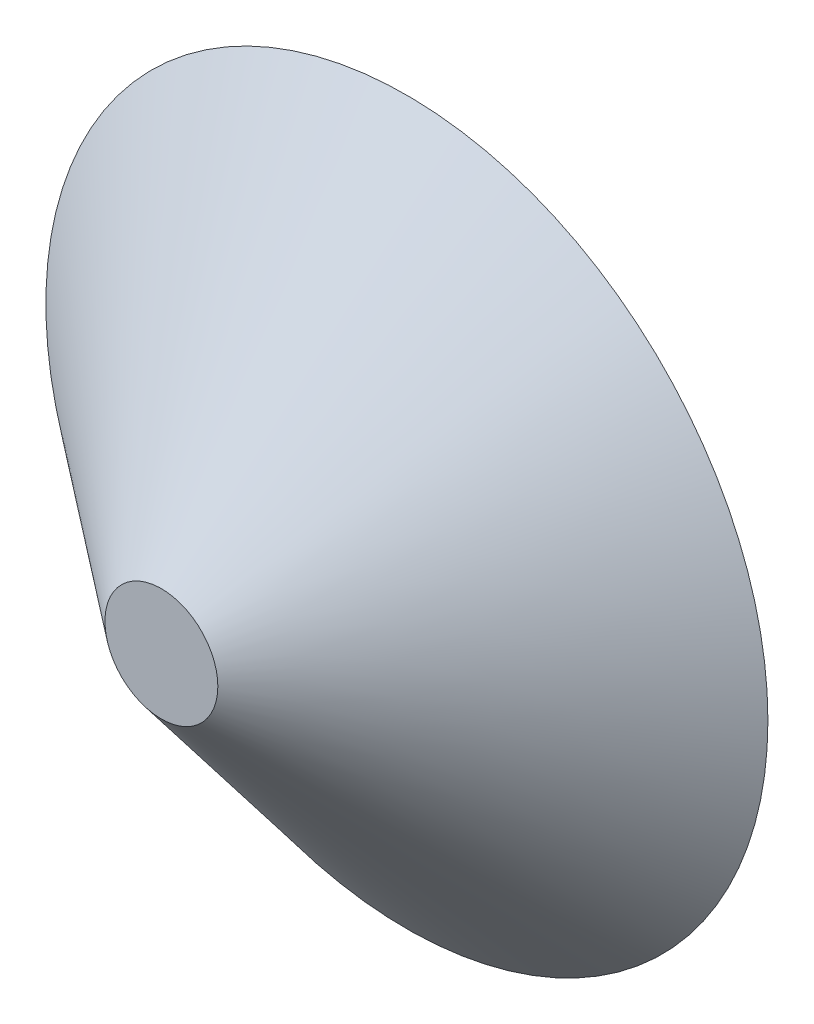
ISO-10303-21;
HEADER;
FILE_DESCRIPTION(('STEP AP214'),'2;1');
FILE_NAME('part.step','',(''),(''),'','','');
FILE_SCHEMA(('AUTOMOTIVE_DESIGN { 1 0 10303 214 1 1 1 1 }'));
ENDSEC;
DATA;
#1=APPLICATION_CONTEXT('core data for automotive mechanical design processes');
#2=APPLICATION_PROTOCOL_DEFINITION('international standard','automotive_design',2000,#1);
#3=PRODUCT_CONTEXT('',#1,'mechanical');
#4=PRODUCT('Part','Part','',(#3));
#5=PRODUCT_RELATED_PRODUCT_CATEGORY('part','',(#4));
#6=PRODUCT_DEFINITION_FORMATION('','',#4);
#7=PRODUCT_DEFINITION_CONTEXT('part definition',#1,'design');
#8=PRODUCT_DEFINITION('design','',#6,#7);
#9=PRODUCT_DEFINITION_SHAPE('','',#8);
#10=(LENGTH_UNIT() NAMED_UNIT(*) SI_UNIT(.MILLI.,.METRE.));
#11=(NAMED_UNIT(*) PLANE_ANGLE_UNIT() SI_UNIT($,.RADIAN.));
#12=(NAMED_UNIT(*) SI_UNIT($,.STERADIAN.) SOLID_ANGLE_UNIT());
#13=UNCERTAINTY_MEASURE_WITH_UNIT(LENGTH_MEASURE(1.E-05),#10,'distance_accuracy_value','');
#14=(GEOMETRIC_REPRESENTATION_CONTEXT(3) GLOBAL_UNCERTAINTY_ASSIGNED_CONTEXT((#13)) GLOBAL_UNIT_ASSIGNED_CONTEXT((#10,
#11,#12)) REPRESENTATION_CONTEXT('',''));
#15=CARTESIAN_POINT('',(0.,0.,0.));
#16=DIRECTION('',(0.,0.,1.));
#17=DIRECTION('',(1.,0.,0.));
#18=AXIS2_PLACEMENT_3D('',#15,#16,#17);
#19=CARTESIAN_POINT('',(0.,0.,0.));
#20=DIRECTION('',(0.,0.,-1.));
#21=DIRECTION('',(1.,0.,0.));
#22=AXIS2_PLACEMENT_3D('',#19,#20,#21);
#23=CONICAL_SURFACE('',#22,140.,0.892386846544703);
#24=CARTESIAN_POINT('',(0.,0.,95.2));
#25=DIRECTION('',(0.,0.,1.));
#26=DIRECTION('',(1.,0.,0.));
#27=AXIS2_PLACEMENT_3D('',#24,#25,#26);
#28=CIRCLE('',#27,21.8908586619484);
#29=CARTESIAN_POINT('',(21.8908586619484,0.,95.2));
#30=VERTEX_POINT('',#29);
#31=EDGE_CURVE('E10',#30,#30,#28,.T.);
#32=CARTESIAN_POINT('',(0.,0.,0.));
#33=DIRECTION('',(0.,0.,1.));
#34=DIRECTION('',(1.,0.,0.));
#35=AXIS2_PLACEMENT_3D('',#32,#33,#34);
#36=CIRCLE('',#35,140.);
#37=CARTESIAN_POINT('',(140.,0.,0.));
#38=VERTEX_POINT('',#37);
#39=EDGE_CURVE('E39',#38,#38,#36,.T.);
#40=CARTESIAN_POINT('',(21.8908586619484,0.,95.2));
#41=CARTESIAN_POINT('',(23.1211622175531,0.,94.2083333333333));
#42=CARTESIAN_POINT('',(24.3514657731578,0.,93.2166666666667));
#43=CARTESIAN_POINT('',(26.8120728843672,0.,91.2333333333333));
#44=CARTESIAN_POINT('',(28.0423764399719,0.,90.2416666666667));
#45=CARTESIAN_POINT('',(30.5029835511813,0.,88.2583333333333));
#46=CARTESIAN_POINT('',(31.733287106786,0.,87.2666666666667));
#47=CARTESIAN_POINT('',(34.1938942179955,0.,85.2833333333333));
#48=CARTESIAN_POINT('',(35.4241977736002,0.,84.2916666666667));
#49=CARTESIAN_POINT('',(37.8848048848096,0.,82.3083333333334));
#50=CARTESIAN_POINT('',(39.1151084404143,0.,81.3166666666667));
#51=CARTESIAN_POINT('',(41.5757155516237,0.,79.3333333333333));
#52=CARTESIAN_POINT('',(42.8060191072284,0.,78.3416666666667));
#53=CARTESIAN_POINT('',(45.2666262184378,0.,76.3583333333333));
#54=CARTESIAN_POINT('',(46.4969297740425,0.,75.3666666666667));
#55=CARTESIAN_POINT('',(48.9575368852519,0.,73.3833333333333));
#56=CARTESIAN_POINT('',(50.1878404408566,0.,72.3916666666667));
#57=CARTESIAN_POINT('',(52.648447552066,0.,70.4083333333333));
#58=CARTESIAN_POINT('',(53.8787511076707,0.,69.4166666666667));
#59=CARTESIAN_POINT('',(56.3393582188801,0.,67.4333333333334));
#60=CARTESIAN_POINT('',(57.5696617744848,0.,66.4416666666667));
#61=CARTESIAN_POINT('',(60.0302688856943,0.,64.4583333333333));
#62=CARTESIAN_POINT('',(61.260572441299,0.,63.4666666666667));
#63=CARTESIAN_POINT('',(63.7211795525084,0.,61.4833333333333));
#64=CARTESIAN_POINT('',(64.9514831081131,0.,60.4916666666667));
#65=CARTESIAN_POINT('',(67.4120902193225,0.,58.5083333333333));
#66=CARTESIAN_POINT('',(68.6423937749272,0.,57.5166666666667));
#67=CARTESIAN_POINT('',(71.1030008861366,0.,55.5333333333333));
#68=CARTESIAN_POINT('',(72.3333044417413,0.,54.5416666666667));
#69=CARTESIAN_POINT('',(74.7939115529507,0.,52.5583333333333));
#70=CARTESIAN_POINT('',(76.0242151085554,0.,51.5666666666667));
#71=CARTESIAN_POINT('',(78.4848222197648,0.,49.5833333333333));
#72=CARTESIAN_POINT('',(79.7151257753695,0.,48.5916666666667));
#73=CARTESIAN_POINT('',(82.1757328865789,0.,46.6083333333333));
#74=CARTESIAN_POINT('',(83.4060364421836,0.,45.6166666666667));
#75=CARTESIAN_POINT('',(85.866643553393,0.,43.6333333333333));
#76=CARTESIAN_POINT('',(87.0969471089978,0.,42.6416666666667));
#77=CARTESIAN_POINT('',(89.5575542202072,0.,40.6583333333333));
#78=CARTESIAN_POINT('',(90.7878577758119,0.,39.6666666666667));
#79=CARTESIAN_POINT('',(93.2484648870213,0.,37.6833333333333));
#80=CARTESIAN_POINT('',(94.478768442626,0.,36.6916666666667));
#81=CARTESIAN_POINT('',(96.9393755538354,0.,34.7083333333333));
#82=CARTESIAN_POINT('',(98.1696791094401,0.,33.7166666666667));
#83=CARTESIAN_POINT('',(100.630286220649,0.,31.7333333333333));
#84=CARTESIAN_POINT('',(101.860589776254,0.,30.7416666666667));
#85=CARTESIAN_POINT('',(104.321196887464,0.,28.7583333333333));
#86=CARTESIAN_POINT('',(105.551500443068,0.,27.7666666666667));
#87=CARTESIAN_POINT('',(108.012107554278,0.,25.7833333333333));
#88=CARTESIAN_POINT('',(109.242411109882,0.,24.7916666666667));
#89=CARTESIAN_POINT('',(111.703018221092,0.,22.8083333333333));
#90=CARTESIAN_POINT('',(112.933321776697,0.,21.8166666666667));
#91=CARTESIAN_POINT('',(115.393928887906,0.,19.8333333333333));
#92=CARTESIAN_POINT('',(116.624232443511,0.,18.8416666666667));
#93=CARTESIAN_POINT('',(119.08483955472,0.,16.8583333333333));
#94=CARTESIAN_POINT('',(120.315143110325,0.,15.8666666666667));
#95=CARTESIAN_POINT('',(122.775750221534,0.,13.8833333333333));
#96=CARTESIAN_POINT('',(124.006053777139,0.,12.8916666666667));
#97=CARTESIAN_POINT('',(126.466660888348,0.,10.9083333333333));
#98=CARTESIAN_POINT('',(127.696964443953,0.,9.91666666666667));
#99=CARTESIAN_POINT('',(130.157571555162,0.,7.93333333333333));
#100=CARTESIAN_POINT('',(131.387875110767,0.,6.94166666666667));
#101=CARTESIAN_POINT('',(133.848482221977,0.,4.95833333333333));
#102=CARTESIAN_POINT('',(135.078785777581,0.,3.96666666666667));
#103=CARTESIAN_POINT('',(137.539392888791,0.,1.98333333333334));
#104=CARTESIAN_POINT('',(138.769696444395,0.,0.991666666666666));
#105=CARTESIAN_POINT('',(140.,0.,0.));
#106=B_SPLINE_CURVE_WITH_KNOTS('',3,(#40,#41,#42,#43,#44,#45,#46,#47,#48,#49,#50,#51,#52,#53,
#54,#55,#56,#57,#58,#59,#60,#61,#62,#63,#64,#65,#66,#67,#68,#69,#70,#71,#72,#73,#74,#75,#76,#77,
#78,#79,#80,#81,#82,#83,#84,#85,#86,#87,#88,#89,#90,#91,#92,#93,#94,#95,#96,#97,#98,#99,#100,
#101,#102,#103,#104,#105),.UNSPECIFIED.,.F.,.F.,(4,2,2,2,2,2,2,2,2,2,2,2,2,2,2,2,2,2,2,2,2,2,2,
2,2,2,2,2,2,2,2,2,4),(0.,4.74061668460996,9.48123336921989,14.2218500538298,18.9624667384398,
23.7030834230497,28.4437001076597,33.1843167922696,37.9249334768796,42.6655501614895,
47.4061668460995,52.1467835307094,56.8874002153194,61.6280168999293,66.3686335845393,
71.1092502691492,75.8498669537592,80.5904836383691,85.331100322979,90.071717007589,
94.8123336921989,99.5529503768089,104.293567061419,109.034183746029,113.774800430639,
118.515417115249,123.256033799859,127.996650484469,132.737267169079,137.477883853688,
142.218500538298,146.959117222908,151.699733907518),.UNSPECIFIED.);
#107=EDGE_CURVE('BSEAM33',#30,#38,#106,.T.);
#108=ORIENTED_EDGE('',*,*,#31,.F.);
#109=ORIENTED_EDGE('',*,*,#39,.T.);
#110=ORIENTED_EDGE('',*,*,#107,.T.);
#111=ORIENTED_EDGE('',*,*,#107,.F.);
#112=EDGE_LOOP('',(#108,#110,#109,#111));
#113=FACE_BOUND('',#112,.T.);
#114=ADVANCED_FACE('F33',(#113),#23,.T.);
#115=CARTESIAN_POINT('',(0.,0.,95.2));
#116=DIRECTION('',(0.,0.,1.));
#117=DIRECTION('',(1.,0.,0.));
#118=AXIS2_PLACEMENT_3D('',#115,#116,#117);
#119=PLANE('',#118);
#120=ORIENTED_EDGE('',*,*,#31,.T.);
#121=EDGE_LOOP('',(#120));
#122=FACE_BOUND('',#121,.T.);
#123=ADVANCED_FACE('F67',(#122),#119,.T.);
#124=CARTESIAN_POINT('',(0.,0.,0.));
#125=DIRECTION('',(0.,0.,1.));
#126=DIRECTION('',(1.,0.,0.));
#127=AXIS2_PLACEMENT_3D('',#124,#125,#126);
#128=PLANE('',#127);
#129=CARTESIAN_POINT('',(0.,0.,0.));
#130=DIRECTION('',(0.,0.,1.));
#131=DIRECTION('',(1.,0.,0.));
#132=AXIS2_PLACEMENT_3D('',#129,#130,#131);
#133=CIRCLE('',#132,129.992916712823);
#134=CARTESIAN_POINT('',(129.992916712823,0.,0.));
#135=VERTEX_POINT('',#134);
#136=EDGE_CURVE('E47',#135,#135,#133,.T.);
#137=ORIENTED_EDGE('',*,*,#136,.T.);
#138=EDGE_LOOP('',(#137));
#139=FACE_BOUND('',#138,.T.);
#140=ORIENTED_EDGE('',*,*,#39,.F.);
#141=EDGE_LOOP('',(#140));
#142=FACE_BOUND('',#141,.T.);
#143=ADVANCED_FACE('F53',(#139,#142),#128,.F.);
#144=CARTESIAN_POINT('',(0.,0.,-4.88943117102069));
#145=DIRECTION('',(0.,0.,-1.));
#146=DIRECTION('',(1.,0.,0.));
#147=AXIS2_PLACEMENT_3D('',#144,#145,#146);
#148=CONICAL_SURFACE('',#147,136.058951557789,0.892386846544703);
#149=CARTESIAN_POINT('',(0.,0.,90.2));
#150=DIRECTION('',(0.,0.,1.));
#151=DIRECTION('',(1.,0.,0.));
#152=AXIS2_PLACEMENT_3D('',#149,#150,#151);
#153=CIRCLE('',#152,18.0869865795014);
#154=CARTESIAN_POINT('',(18.0869865795014,0.,90.2));
#155=VERTEX_POINT('',#154);
#156=EDGE_CURVE('E43',#155,#155,#153,.T.);
#157=CARTESIAN_POINT('',(18.0869865795014,0.,90.2));
#158=CARTESIAN_POINT('',(19.2526733517235,0.,89.2604166666666));
#159=CARTESIAN_POINT('',(20.4183601239456,0.,88.3208333333333));
#160=CARTESIAN_POINT('',(22.7497336683898,0.,86.4416666666666));
#161=CARTESIAN_POINT('',(23.9154204406119,0.,85.5020833333333));
#162=CARTESIAN_POINT('',(26.2467939850561,0.,83.6229166666667));
#163=CARTESIAN_POINT('',(27.4124807572782,0.,82.6833333333333));
#164=CARTESIAN_POINT('',(29.7438543017225,0.,80.8041666666667));
#165=CARTESIAN_POINT('',(30.9095410739446,0.,79.8645833333333));
#166=CARTESIAN_POINT('',(33.2409146183888,0.,77.9854166666667));
#167=CARTESIAN_POINT('',(34.4066013906109,0.,77.0458333333333));
#168=CARTESIAN_POINT('',(36.7379749350551,0.,75.1666666666667));
#169=CARTESIAN_POINT('',(37.9036617072772,0.,74.2270833333333));
#170=CARTESIAN_POINT('',(40.2350352517214,0.,72.3479166666666));
#171=CARTESIAN_POINT('',(41.4007220239435,0.,71.4083333333333));
#172=CARTESIAN_POINT('',(43.7320955683877,0.,69.5291666666667));
#173=CARTESIAN_POINT('',(44.8977823406098,0.,68.5895833333333));
#174=CARTESIAN_POINT('',(47.229155885054,0.,66.7104166666667));
#175=CARTESIAN_POINT('',(48.3948426572761,0.,65.7708333333333));
#176=CARTESIAN_POINT('',(50.7262162017203,0.,63.8916666666667));
#177=CARTESIAN_POINT('',(51.8919029739424,0.,62.9520833333333));
#178=CARTESIAN_POINT('',(54.2232765183867,0.,61.0729166666666));
#179=CARTESIAN_POINT('',(55.3889632906088,0.,60.1333333333333));
#180=CARTESIAN_POINT('',(57.720336835053,0.,58.2541666666666));
#181=CARTESIAN_POINT('',(58.8860236072751,0.,57.3145833333333));
#182=CARTESIAN_POINT('',(61.2173971517193,0.,55.4354166666667));
#183=CARTESIAN_POINT('',(62.3830839239414,0.,54.4958333333333));
#184=CARTESIAN_POINT('',(64.7144574683856,0.,52.6166666666667));
#185=CARTESIAN_POINT('',(65.8801442406077,0.,51.6770833333333));
#186=CARTESIAN_POINT('',(68.2115177850519,0.,49.7979166666667));
#187=CARTESIAN_POINT('',(69.377204557274,0.,48.8583333333333));
#188=CARTESIAN_POINT('',(71.7085781017182,0.,46.9791666666667));
#189=CARTESIAN_POINT('',(72.8742648739403,0.,46.0395833333333));
#190=CARTESIAN_POINT('',(75.2056384183845,0.,44.1604166666667));
#191=CARTESIAN_POINT('',(76.3713251906066,0.,43.2208333333333));
#192=CARTESIAN_POINT('',(78.7026987350508,0.,41.3416666666667));
#193=CARTESIAN_POINT('',(79.8683855072729,0.,40.4020833333333));
#194=CARTESIAN_POINT('',(82.1997590517171,0.,38.5229166666667));
#195=CARTESIAN_POINT('',(83.3654458239392,0.,37.5833333333333));
#196=CARTESIAN_POINT('',(85.6968193683835,0.,35.7041666666667));
#197=CARTESIAN_POINT('',(86.8625061406056,0.,34.7645833333333));
#198=CARTESIAN_POINT('',(89.1938796850498,0.,32.8854166666667));
#199=CARTESIAN_POINT('',(90.3595664572719,0.,31.9458333333333));
#200=CARTESIAN_POINT('',(92.6909400017161,0.,30.0666666666667));
#201=CARTESIAN_POINT('',(93.8566267739382,0.,29.1270833333333));
#202=CARTESIAN_POINT('',(96.1880003183824,0.,27.2479166666667));
#203=CARTESIAN_POINT('',(97.3536870906045,0.,26.3083333333333));
#204=CARTESIAN_POINT('',(99.6850606350487,0.,24.4291666666667));
#205=CARTESIAN_POINT('',(100.850747407271,0.,23.4895833333333));
#206=CARTESIAN_POINT('',(103.182120951715,0.,21.6104166666667));
#207=CARTESIAN_POINT('',(104.347807723937,0.,20.6708333333333));
#208=CARTESIAN_POINT('',(106.679181268381,0.,18.7916666666667));
#209=CARTESIAN_POINT('',(107.844868040603,0.,17.8520833333333));
#210=CARTESIAN_POINT('',(110.176241585048,0.,15.9729166666667));
#211=CARTESIAN_POINT('',(111.34192835727,0.,15.0333333333333));
#212=CARTESIAN_POINT('',(113.673301901714,0.,13.1541666666667));
#213=CARTESIAN_POINT('',(114.838988673936,0.,12.2145833333333));
#214=CARTESIAN_POINT('',(117.17036221838,0.,10.3354166666667));
#215=CARTESIAN_POINT('',(118.336048990602,0.,9.39583333333333));
#216=CARTESIAN_POINT('',(120.667422535047,0.,7.51666666666666));
#217=CARTESIAN_POINT('',(121.833109307269,0.,6.57708333333333));
#218=CARTESIAN_POINT('',(124.164482851713,0.,4.69791666666666));
#219=CARTESIAN_POINT('',(125.330169623935,0.,3.75833333333333));
#220=CARTESIAN_POINT('',(127.661543168379,0.,1.87916666666666));
#221=CARTESIAN_POINT('',(128.827229940601,0.,0.93958333333333));
#222=CARTESIAN_POINT('',(129.992916712823,0.,0.));
#223=B_SPLINE_CURVE_WITH_KNOTS('',3,(#157,#158,#159,#160,#161,#162,#163,#164,#165,#166,#167,
#168,#169,#170,#171,#172,#173,#174,#175,#176,#177,#178,#179,#180,#181,#182,#183,#184,#185,#186,
#187,#188,#189,#190,#191,#192,#193,#194,#195,#196,#197,#198,#199,#200,#201,#202,#203,#204,#205,
#206,#207,#208,#209,#210,#211,#212,#213,#214,#215,#216,#217,#218,#219,#220,#221,#222),
.UNSPECIFIED.,.F.,.F.,(4,2,2,2,2,2,2,2,2,2,2,2,2,2,2,2,2,2,2,2,2,2,2,2,2,2,2,2,2,2,2,2,4),(0.,
4.49163471588042,8.98326943176087,13.4749041476413,17.9665388635217,22.4581735794022,
26.9498082952826,31.441443011163,35.9330777270435,40.4247124429239,44.9163471588043,
49.4079818746848,53.8996165905652,58.3912513064456,62.882886022326,67.3745207382065,
71.8661554540869,76.3577901699673,80.8494248858478,85.3410596017282,89.8326943176086,
94.3243290334891,98.8159637493695,103.30759846525,107.79923318113,112.290867897011,
116.782502612891,121.274137328772,125.765772044652,130.257406760533,134.749041476413,
139.240676192293,143.732310908174),.UNSPECIFIED.);
#224=EDGE_CURVE('BSEAM56',#155,#135,#223,.T.);
#225=ORIENTED_EDGE('',*,*,#156,.T.);
#226=ORIENTED_EDGE('',*,*,#136,.F.);
#227=ORIENTED_EDGE('',*,*,#224,.T.);
#228=ORIENTED_EDGE('',*,*,#224,.F.);
#229=EDGE_LOOP('',(#225,#227,#226,#228));
#230=FACE_BOUND('',#229,.T.);
#231=ADVANCED_FACE('F56',(#230),#148,.F.);
#232=CARTESIAN_POINT('',(0.,0.,90.2));
#233=DIRECTION('',(0.,0.,1.));
#234=DIRECTION('',(1.,0.,0.));
#235=AXIS2_PLACEMENT_3D('',#232,#233,#234);
#236=PLANE('',#235);
#237=ORIENTED_EDGE('',*,*,#156,.F.);
#238=EDGE_LOOP('',(#237));
#239=FACE_BOUND('',#238,.T.);
#240=ADVANCED_FACE('F58',(#239),#236,.F.);
#241=CLOSED_SHELL('',(#114,#123,#143,#231,#240));
#242=MANIFOLD_SOLID_BREP('B2',#241);
#243=ADVANCED_BREP_SHAPE_REPRESENTATION('',(#18,#242),#14);
#244=SHAPE_DEFINITION_REPRESENTATION(#9,#243);
ENDSEC;
END-ISO-10303-21;
